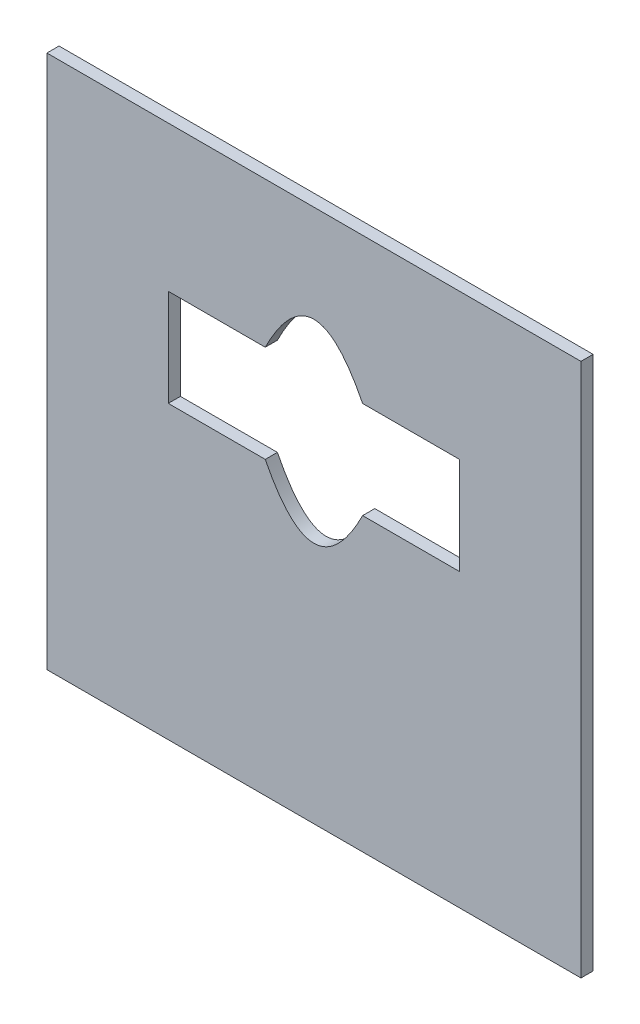
ISO-10303-21;
HEADER;
FILE_DESCRIPTION(('STEP AP214'),'2;1');
FILE_NAME('part.step','',(''),(''),'','','');
FILE_SCHEMA(('AUTOMOTIVE_DESIGN { 1 0 10303 214 1 1 1 1 }'));
ENDSEC;
DATA;
#1=APPLICATION_CONTEXT('core data for automotive mechanical design processes');
#2=APPLICATION_PROTOCOL_DEFINITION('international standard','automotive_design',2000,#1);
#3=PRODUCT_CONTEXT('',#1,'mechanical');
#4=PRODUCT('Part','Part','',(#3));
#5=PRODUCT_RELATED_PRODUCT_CATEGORY('part','',(#4));
#6=PRODUCT_DEFINITION_FORMATION('','',#4);
#7=PRODUCT_DEFINITION_CONTEXT('part definition',#1,'design');
#8=PRODUCT_DEFINITION('design','',#6,#7);
#9=PRODUCT_DEFINITION_SHAPE('','',#8);
#10=(LENGTH_UNIT() NAMED_UNIT(*) SI_UNIT(.MILLI.,.METRE.));
#11=(NAMED_UNIT(*) PLANE_ANGLE_UNIT() SI_UNIT($,.RADIAN.));
#12=(NAMED_UNIT(*) SI_UNIT($,.STERADIAN.) SOLID_ANGLE_UNIT());
#13=UNCERTAINTY_MEASURE_WITH_UNIT(LENGTH_MEASURE(1.E-05),#10,'distance_accuracy_value','');
#14=(GEOMETRIC_REPRESENTATION_CONTEXT(3) GLOBAL_UNCERTAINTY_ASSIGNED_CONTEXT((#13)) GLOBAL_UNIT_ASSIGNED_CONTEXT((#10,
#11,#12)) REPRESENTATION_CONTEXT('',''));
#15=CARTESIAN_POINT('',(0.,0.,0.));
#16=DIRECTION('',(0.,0.,1.));
#17=DIRECTION('',(1.,0.,0.));
#18=AXIS2_PLACEMENT_3D('',#15,#16,#17);
#19=CARTESIAN_POINT('',(0.,0.,3.175));
#20=DIRECTION('',(0.,0.,-1.));
#21=DIRECTION('',(-1.,0.,0.));
#22=AXIS2_PLACEMENT_3D('',#19,#20,#21);
#23=PLANE('',#22);
#24=DIRECTION('',(0.,-1.,0.));
#25=VECTOR('',#24,1.);
#26=CARTESIAN_POINT('',(0.,0.,3.175));
#27=LINE('',#26,#25);
#28=CARTESIAN_POINT('',(0.,139.7,3.175));
#29=VERTEX_POINT('',#28);
#30=CARTESIAN_POINT('',(0.,0.,3.175));
#31=VERTEX_POINT('',#30);
#32=EDGE_CURVE('E206',#29,#31,#27,.T.);
#33=ORIENTED_EDGE('',*,*,#32,.T.);
#34=DIRECTION('',(1.,0.,0.));
#35=VECTOR('',#34,1.);
#36=CARTESIAN_POINT('',(0.,0.,3.175));
#37=LINE('',#36,#35);
#38=CARTESIAN_POINT('',(139.7,0.,3.175));
#39=VERTEX_POINT('',#38);
#40=EDGE_CURVE('E219',#31,#39,#37,.T.);
#41=ORIENTED_EDGE('',*,*,#40,.T.);
#42=DIRECTION('',(0.,1.,0.));
#43=VECTOR('',#42,1.);
#44=CARTESIAN_POINT('',(139.7,0.,3.175));
#45=LINE('',#44,#43);
#46=CARTESIAN_POINT('',(139.7,139.7,3.175));
#47=VERTEX_POINT('',#46);
#48=EDGE_CURVE('E200',#39,#47,#45,.T.);
#49=ORIENTED_EDGE('',*,*,#48,.T.);
#50=DIRECTION('',(-1.,0.,0.));
#51=VECTOR('',#50,1.);
#52=CARTESIAN_POINT('',(0.,139.7,3.175));
#53=LINE('',#52,#51);
#54=EDGE_CURVE('E213',#47,#29,#53,.T.);
#55=ORIENTED_EDGE('',*,*,#54,.T.);
#56=EDGE_LOOP('',(#33,#41,#49,#55));
#57=FACE_BOUND('',#56,.T.);
#58=DIRECTION('',(0.,-1.,0.));
#59=VECTOR('',#58,1.);
#60=CARTESIAN_POINT('',(31.75,101.6,3.175));
#61=LINE('',#60,#59);
#62=CARTESIAN_POINT('',(31.75,101.6,3.175));
#63=VERTEX_POINT('',#62);
#64=CARTESIAN_POINT('',(31.75,76.2,3.175));
#65=VERTEX_POINT('',#64);
#66=EDGE_CURVE('E122',#63,#65,#61,.T.);
#67=ORIENTED_EDGE('',*,*,#66,.F.);
#68=DIRECTION('',(-1.,0.,0.));
#69=VECTOR('',#68,1.);
#70=CARTESIAN_POINT('',(31.75,101.6,3.175));
#71=LINE('',#70,#69);
#72=CARTESIAN_POINT('',(57.1143014780836,101.6,3.175));
#73=VERTEX_POINT('',#72);
#74=EDGE_CURVE('E235',#73,#63,#71,.T.);
#75=ORIENTED_EDGE('',*,*,#74,.F.);
#76=CARTESIAN_POINT('',(82.5856985219164,101.6,3.175));
#77=CARTESIAN_POINT('',(69.85,127.,3.175));
#78=CARTESIAN_POINT('',(57.1143014780836,101.6,3.175));
#79=B_SPLINE_CURVE_WITH_KNOTS('',2,(#76,#77,#78),.UNSPECIFIED.,.F.,.F.,(3,3),(0.,1.),.UNSPECIFIED.);
#80=CARTESIAN_POINT('',(82.5856985219164,101.6,3.175));
#81=VERTEX_POINT('',#80);
#82=EDGE_CURVE('E266',#81,#73,#79,.T.);
#83=ORIENTED_EDGE('',*,*,#82,.F.);
#84=DIRECTION('',(-1.,0.,0.));
#85=VECTOR('',#84,1.);
#86=CARTESIAN_POINT('',(82.5856985219164,101.6,3.175));
#87=LINE('',#86,#85);
#88=CARTESIAN_POINT('',(107.95,101.6,3.175));
#89=VERTEX_POINT('',#88);
#90=EDGE_CURVE('E271',#89,#81,#87,.T.);
#91=ORIENTED_EDGE('',*,*,#90,.F.);
#92=DIRECTION('',(0.,1.,0.));
#93=VECTOR('',#92,1.);
#94=CARTESIAN_POINT('',(107.95,101.6,3.175));
#95=LINE('',#94,#93);
#96=CARTESIAN_POINT('',(107.95,76.2,3.175));
#97=VERTEX_POINT('',#96);
#98=EDGE_CURVE('E300',#97,#89,#95,.T.);
#99=ORIENTED_EDGE('',*,*,#98,.F.);
#100=DIRECTION('',(1.,0.,0.));
#101=VECTOR('',#100,1.);
#102=CARTESIAN_POINT('',(82.5856985219164,76.2,3.175));
#103=LINE('',#102,#101);
#104=CARTESIAN_POINT('',(82.5856985219164,76.2,3.175));
#105=VERTEX_POINT('',#104);
#106=EDGE_CURVE('E145',#105,#97,#103,.T.);
#107=ORIENTED_EDGE('',*,*,#106,.F.);
#108=CARTESIAN_POINT('',(57.1143014780836,76.2,3.175));
#109=CARTESIAN_POINT('',(69.85,50.9177436289501,3.175));
#110=CARTESIAN_POINT('',(82.5856985219164,76.2,3.175));
#111=B_SPLINE_CURVE_WITH_KNOTS('',2,(#108,#109,#110),.UNSPECIFIED.,.F.,.F.,(3,3),(0.,1.),.UNSPECIFIED.);
#112=CARTESIAN_POINT('',(57.1143014780836,76.2,3.175));
#113=VERTEX_POINT('',#112);
#114=EDGE_CURVE('E143',#113,#105,#111,.T.);
#115=ORIENTED_EDGE('',*,*,#114,.F.);
#116=DIRECTION('',(1.,0.,0.));
#117=VECTOR('',#116,1.);
#118=CARTESIAN_POINT('',(31.75,76.2,3.175));
#119=LINE('',#118,#117);
#120=EDGE_CURVE('E130',#65,#113,#119,.T.);
#121=ORIENTED_EDGE('',*,*,#120,.F.);
#122=EDGE_LOOP('',(#67,#75,#83,#91,#99,#107,#115,#121));
#123=FACE_BOUND('',#122,.T.);
#124=ADVANCED_FACE('F33',(#57,#123),#23,.F.);
#125=CARTESIAN_POINT('',(0.,0.,0.));
#126=DIRECTION('',(0.,0.,-1.));
#127=DIRECTION('',(-1.,0.,0.));
#128=AXIS2_PLACEMENT_3D('',#125,#126,#127);
#129=PLANE('',#128);
#130=DIRECTION('',(0.,-1.,0.));
#131=VECTOR('',#130,1.);
#132=CARTESIAN_POINT('',(0.,0.,0.));
#133=LINE('',#132,#131);
#134=CARTESIAN_POINT('',(0.,139.7,0.));
#135=VERTEX_POINT('',#134);
#136=CARTESIAN_POINT('',(0.,0.,0.));
#137=VERTEX_POINT('',#136);
#138=EDGE_CURVE('E138',#135,#137,#133,.T.);
#139=ORIENTED_EDGE('',*,*,#138,.F.);
#140=DIRECTION('',(-1.,0.,0.));
#141=VECTOR('',#140,1.);
#142=CARTESIAN_POINT('',(0.,139.7,0.));
#143=LINE('',#142,#141);
#144=CARTESIAN_POINT('',(139.7,139.7,0.));
#145=VERTEX_POINT('',#144);
#146=EDGE_CURVE('E204',#145,#135,#143,.T.);
#147=ORIENTED_EDGE('',*,*,#146,.F.);
#148=DIRECTION('',(0.,1.,0.));
#149=VECTOR('',#148,1.);
#150=CARTESIAN_POINT('',(139.7,0.,0.));
#151=LINE('',#150,#149);
#152=CARTESIAN_POINT('',(139.7,0.,0.));
#153=VERTEX_POINT('',#152);
#154=EDGE_CURVE('E196',#153,#145,#151,.T.);
#155=ORIENTED_EDGE('',*,*,#154,.F.);
#156=DIRECTION('',(1.,0.,0.));
#157=VECTOR('',#156,1.);
#158=CARTESIAN_POINT('',(0.,0.,0.));
#159=LINE('',#158,#157);
#160=EDGE_CURVE('E189',#137,#153,#159,.T.);
#161=ORIENTED_EDGE('',*,*,#160,.F.);
#162=EDGE_LOOP('',(#139,#147,#155,#161));
#163=FACE_BOUND('',#162,.T.);
#164=DIRECTION('',(-1.,0.,0.));
#165=VECTOR('',#164,1.);
#166=CARTESIAN_POINT('',(31.75,101.6,0.));
#167=LINE('',#166,#165);
#168=CARTESIAN_POINT('',(57.1143014780836,101.6,0.));
#169=VERTEX_POINT('',#168);
#170=CARTESIAN_POINT('',(31.75,101.6,0.));
#171=VERTEX_POINT('',#170);
#172=EDGE_CURVE('E131',#169,#171,#167,.T.);
#173=ORIENTED_EDGE('',*,*,#172,.T.);
#174=DIRECTION('',(0.,-1.,0.));
#175=VECTOR('',#174,1.);
#176=CARTESIAN_POINT('',(31.75,101.6,0.));
#177=LINE('',#176,#175);
#178=CARTESIAN_POINT('',(31.75,76.2,0.));
#179=VERTEX_POINT('',#178);
#180=EDGE_CURVE('E56',#171,#179,#177,.T.);
#181=ORIENTED_EDGE('',*,*,#180,.T.);
#182=DIRECTION('',(1.,0.,0.));
#183=VECTOR('',#182,1.);
#184=CARTESIAN_POINT('',(31.75,76.2,0.));
#185=LINE('',#184,#183);
#186=CARTESIAN_POINT('',(57.1143014780836,76.2,0.));
#187=VERTEX_POINT('',#186);
#188=EDGE_CURVE('E137',#179,#187,#185,.T.);
#189=ORIENTED_EDGE('',*,*,#188,.T.);
#190=CARTESIAN_POINT('',(57.1143014780836,76.2,0.));
#191=CARTESIAN_POINT('',(69.85,50.9177436289501,0.));
#192=CARTESIAN_POINT('',(82.5856985219164,76.2,0.));
#193=B_SPLINE_CURVE_WITH_KNOTS('',2,(#190,#191,#192),.UNSPECIFIED.,.F.,.F.,(3,3),(0.,1.),.UNSPECIFIED.);
#194=CARTESIAN_POINT('',(82.5856985219164,76.2,0.));
#195=VERTEX_POINT('',#194);
#196=EDGE_CURVE('E255',#187,#195,#193,.T.);
#197=ORIENTED_EDGE('',*,*,#196,.T.);
#198=DIRECTION('',(1.,0.,0.));
#199=VECTOR('',#198,1.);
#200=CARTESIAN_POINT('',(82.5856985219164,76.2,0.));
#201=LINE('',#200,#199);
#202=CARTESIAN_POINT('',(107.95,76.2,0.));
#203=VERTEX_POINT('',#202);
#204=EDGE_CURVE('E252',#195,#203,#201,.T.);
#205=ORIENTED_EDGE('',*,*,#204,.T.);
#206=DIRECTION('',(0.,1.,0.));
#207=VECTOR('',#206,1.);
#208=CARTESIAN_POINT('',(107.95,101.6,0.));
#209=LINE('',#208,#207);
#210=CARTESIAN_POINT('',(107.95,101.6,0.));
#211=VERTEX_POINT('',#210);
#212=EDGE_CURVE('E249',#203,#211,#209,.T.);
#213=ORIENTED_EDGE('',*,*,#212,.T.);
#214=DIRECTION('',(-1.,0.,0.));
#215=VECTOR('',#214,1.);
#216=CARTESIAN_POINT('',(82.5856985219164,101.6,0.));
#217=LINE('',#216,#215);
#218=CARTESIAN_POINT('',(82.5856985219164,101.6,0.));
#219=VERTEX_POINT('',#218);
#220=EDGE_CURVE('E243',#211,#219,#217,.T.);
#221=ORIENTED_EDGE('',*,*,#220,.T.);
#222=CARTESIAN_POINT('',(82.5856985219164,101.6,0.));
#223=CARTESIAN_POINT('',(69.85,127.,0.));
#224=CARTESIAN_POINT('',(57.1143014780836,101.6,0.));
#225=B_SPLINE_CURVE_WITH_KNOTS('',2,(#222,#223,#224),.UNSPECIFIED.,.F.,.F.,(3,3),(0.,1.),.UNSPECIFIED.);
#226=EDGE_CURVE('E238',#219,#169,#225,.T.);
#227=ORIENTED_EDGE('',*,*,#226,.T.);
#228=EDGE_LOOP('',(#173,#181,#189,#197,#205,#213,#221,#227));
#229=FACE_BOUND('',#228,.T.);
#230=ADVANCED_FACE('F170',(#163,#229),#129,.T.);
#231=CARTESIAN_POINT('',(0.,0.,3.175));
#232=DIRECTION('',(1.,0.,0.));
#233=DIRECTION('',(0.,0.,-1.));
#234=AXIS2_PLACEMENT_3D('',#231,#232,#233);
#235=PLANE('',#234);
#236=ORIENTED_EDGE('',*,*,#138,.T.);
#237=DIRECTION('',(0.,0.,-1.));
#238=VECTOR('',#237,1.);
#239=CARTESIAN_POINT('',(0.,0.,3.175));
#240=LINE('',#239,#238);
#241=EDGE_CURVE('E11',#31,#137,#240,.T.);
#242=ORIENTED_EDGE('',*,*,#241,.F.);
#243=ORIENTED_EDGE('',*,*,#32,.F.);
#244=DIRECTION('',(0.,0.,-1.));
#245=VECTOR('',#244,1.);
#246=CARTESIAN_POINT('',(0.,139.7,3.175));
#247=LINE('',#246,#245);
#248=EDGE_CURVE('E210',#29,#135,#247,.T.);
#249=ORIENTED_EDGE('',*,*,#248,.T.);
#250=EDGE_LOOP('',(#236,#242,#243,#249));
#251=FACE_BOUND('',#250,.T.);
#252=ADVANCED_FACE('F35',(#251),#235,.F.);
#253=CARTESIAN_POINT('',(0.,0.,3.175));
#254=DIRECTION('',(0.,1.,0.));
#255=DIRECTION('',(0.,0.,1.));
#256=AXIS2_PLACEMENT_3D('',#253,#254,#255);
#257=PLANE('',#256);
#258=ORIENTED_EDGE('',*,*,#160,.T.);
#259=DIRECTION('',(0.,0.,-1.));
#260=VECTOR('',#259,1.);
#261=CARTESIAN_POINT('',(139.7,0.,3.175));
#262=LINE('',#261,#260);
#263=EDGE_CURVE('E41',#39,#153,#262,.T.);
#264=ORIENTED_EDGE('',*,*,#263,.F.);
#265=ORIENTED_EDGE('',*,*,#40,.F.);
#266=ORIENTED_EDGE('',*,*,#241,.T.);
#267=EDGE_LOOP('',(#258,#264,#265,#266));
#268=FACE_BOUND('',#267,.T.);
#269=ADVANCED_FACE('F180',(#268),#257,.F.);
#270=CARTESIAN_POINT('',(139.7,0.,3.175));
#271=DIRECTION('',(-1.,0.,0.));
#272=DIRECTION('',(0.,0.,1.));
#273=AXIS2_PLACEMENT_3D('',#270,#271,#272);
#274=PLANE('',#273);
#275=ORIENTED_EDGE('',*,*,#154,.T.);
#276=DIRECTION('',(0.,0.,-1.));
#277=VECTOR('',#276,1.);
#278=CARTESIAN_POINT('',(139.7,139.7,3.175));
#279=LINE('',#278,#277);
#280=EDGE_CURVE('E201',#47,#145,#279,.T.);
#281=ORIENTED_EDGE('',*,*,#280,.F.);
#282=ORIENTED_EDGE('',*,*,#48,.F.);
#283=ORIENTED_EDGE('',*,*,#263,.T.);
#284=EDGE_LOOP('',(#275,#281,#282,#283));
#285=FACE_BOUND('',#284,.T.);
#286=ADVANCED_FACE('F177',(#285),#274,.F.);
#287=CARTESIAN_POINT('',(0.,139.7,3.175));
#288=DIRECTION('',(0.,-1.,0.));
#289=DIRECTION('',(0.,0.,-1.));
#290=AXIS2_PLACEMENT_3D('',#287,#288,#289);
#291=PLANE('',#290);
#292=ORIENTED_EDGE('',*,*,#146,.T.);
#293=ORIENTED_EDGE('',*,*,#248,.F.);
#294=ORIENTED_EDGE('',*,*,#54,.F.);
#295=ORIENTED_EDGE('',*,*,#280,.T.);
#296=EDGE_LOOP('',(#292,#293,#294,#295));
#297=FACE_BOUND('',#296,.T.);
#298=ADVANCED_FACE('F167',(#297),#291,.F.);
#299=CARTESIAN_POINT('',(31.75,101.6,3.175));
#300=DIRECTION('',(1.,0.,0.));
#301=DIRECTION('',(0.,0.,-1.));
#302=AXIS2_PLACEMENT_3D('',#299,#300,#301);
#303=PLANE('',#302);
#304=ORIENTED_EDGE('',*,*,#180,.F.);
#305=DIRECTION('',(0.,0.,-1.));
#306=VECTOR('',#305,1.);
#307=CARTESIAN_POINT('',(31.75,101.6,3.175));
#308=LINE('',#307,#306);
#309=EDGE_CURVE('E126',#63,#171,#308,.T.);
#310=ORIENTED_EDGE('',*,*,#309,.F.);
#311=ORIENTED_EDGE('',*,*,#66,.T.);
#312=DIRECTION('',(0.,0.,-1.));
#313=VECTOR('',#312,1.);
#314=CARTESIAN_POINT('',(31.75,76.2,3.175));
#315=LINE('',#314,#313);
#316=EDGE_CURVE('E125',#65,#179,#315,.T.);
#317=ORIENTED_EDGE('',*,*,#316,.T.);
#318=EDGE_LOOP('',(#304,#310,#311,#317));
#319=FACE_BOUND('',#318,.T.);
#320=ADVANCED_FACE('F124',(#319),#303,.T.);
#321=CARTESIAN_POINT('',(31.75,76.2,3.175));
#322=DIRECTION('',(0.,1.,0.));
#323=DIRECTION('',(0.,0.,1.));
#324=AXIS2_PLACEMENT_3D('',#321,#322,#323);
#325=PLANE('',#324);
#326=ORIENTED_EDGE('',*,*,#188,.F.);
#327=ORIENTED_EDGE('',*,*,#316,.F.);
#328=ORIENTED_EDGE('',*,*,#120,.T.);
#329=DIRECTION('',(0.,0.,-1.));
#330=VECTOR('',#329,1.);
#331=CARTESIAN_POINT('',(57.1143014780836,76.2,3.175));
#332=LINE('',#331,#330);
#333=EDGE_CURVE('E139',#113,#187,#332,.T.);
#334=ORIENTED_EDGE('',*,*,#333,.T.);
#335=EDGE_LOOP('',(#326,#327,#328,#334));
#336=FACE_BOUND('',#335,.T.);
#337=ADVANCED_FACE('F134',(#336),#325,.T.);
#338=DIRECTION('',(0.,0.,-1.));
#339=VECTOR('',#338,1.);
#340=SURFACE_OF_LINEAR_EXTRUSION('',#111,#339);
#341=ORIENTED_EDGE('',*,*,#196,.F.);
#342=ORIENTED_EDGE('',*,*,#333,.F.);
#343=ORIENTED_EDGE('',*,*,#114,.T.);
#344=DIRECTION('',(0.,0.,-1.));
#345=VECTOR('',#344,1.);
#346=CARTESIAN_POINT('',(82.5856985219164,76.2,3.175));
#347=LINE('',#346,#345);
#348=EDGE_CURVE('E225',#105,#195,#347,.T.);
#349=ORIENTED_EDGE('',*,*,#348,.T.);
#350=EDGE_LOOP('',(#341,#342,#343,#349));
#351=FACE_BOUND('',#350,.T.);
#352=ADVANCED_FACE('F156',(#351),#340,.T.);
#353=CARTESIAN_POINT('',(82.5856985219164,76.2,3.175));
#354=DIRECTION('',(0.,1.,0.));
#355=DIRECTION('',(0.,0.,1.));
#356=AXIS2_PLACEMENT_3D('',#353,#354,#355);
#357=PLANE('',#356);
#358=ORIENTED_EDGE('',*,*,#204,.F.);
#359=ORIENTED_EDGE('',*,*,#348,.F.);
#360=ORIENTED_EDGE('',*,*,#106,.T.);
#361=DIRECTION('',(0.,0.,-1.));
#362=VECTOR('',#361,1.);
#363=CARTESIAN_POINT('',(107.95,76.2,3.175));
#364=LINE('',#363,#362);
#365=EDGE_CURVE('E227',#97,#203,#364,.T.);
#366=ORIENTED_EDGE('',*,*,#365,.T.);
#367=EDGE_LOOP('',(#358,#359,#360,#366));
#368=FACE_BOUND('',#367,.T.);
#369=ADVANCED_FACE('F160',(#368),#357,.T.);
#370=CARTESIAN_POINT('',(107.95,101.6,3.175));
#371=DIRECTION('',(-1.,0.,0.));
#372=DIRECTION('',(0.,0.,1.));
#373=AXIS2_PLACEMENT_3D('',#370,#371,#372);
#374=PLANE('',#373);
#375=ORIENTED_EDGE('',*,*,#212,.F.);
#376=ORIENTED_EDGE('',*,*,#365,.F.);
#377=ORIENTED_EDGE('',*,*,#98,.T.);
#378=DIRECTION('',(0.,0.,-1.));
#379=VECTOR('',#378,1.);
#380=CARTESIAN_POINT('',(107.95,101.6,3.175));
#381=LINE('',#380,#379);
#382=EDGE_CURVE('E229',#89,#211,#381,.T.);
#383=ORIENTED_EDGE('',*,*,#382,.T.);
#384=EDGE_LOOP('',(#375,#376,#377,#383));
#385=FACE_BOUND('',#384,.T.);
#386=ADVANCED_FACE('F284',(#385),#374,.T.);
#387=CARTESIAN_POINT('',(82.5856985219164,101.6,3.175));
#388=DIRECTION('',(0.,-1.,0.));
#389=DIRECTION('',(0.,0.,-1.));
#390=AXIS2_PLACEMENT_3D('',#387,#388,#389);
#391=PLANE('',#390);
#392=ORIENTED_EDGE('',*,*,#220,.F.);
#393=ORIENTED_EDGE('',*,*,#382,.F.);
#394=ORIENTED_EDGE('',*,*,#90,.T.);
#395=DIRECTION('',(0.,0.,-1.));
#396=VECTOR('',#395,1.);
#397=CARTESIAN_POINT('',(82.5856985219164,101.6,3.175));
#398=LINE('',#397,#396);
#399=EDGE_CURVE('E231',#81,#219,#398,.T.);
#400=ORIENTED_EDGE('',*,*,#399,.T.);
#401=EDGE_LOOP('',(#392,#393,#394,#400));
#402=FACE_BOUND('',#401,.T.);
#403=ADVANCED_FACE('F281',(#402),#391,.T.);
#404=DIRECTION('',(0.,0.,-1.));
#405=VECTOR('',#404,1.);
#406=SURFACE_OF_LINEAR_EXTRUSION('',#79,#405);
#407=ORIENTED_EDGE('',*,*,#226,.F.);
#408=ORIENTED_EDGE('',*,*,#399,.F.);
#409=ORIENTED_EDGE('',*,*,#82,.T.);
#410=DIRECTION('',(0.,0.,-1.));
#411=VECTOR('',#410,1.);
#412=CARTESIAN_POINT('',(57.1143014780836,101.6,3.175));
#413=LINE('',#412,#411);
#414=EDGE_CURVE('E48',#73,#169,#413,.T.);
#415=ORIENTED_EDGE('',*,*,#414,.T.);
#416=EDGE_LOOP('',(#407,#408,#409,#415));
#417=FACE_BOUND('',#416,.T.);
#418=ADVANCED_FACE('F276',(#417),#406,.T.);
#419=CARTESIAN_POINT('',(31.75,101.6,3.175));
#420=DIRECTION('',(0.,-1.,0.));
#421=DIRECTION('',(0.,0.,-1.));
#422=AXIS2_PLACEMENT_3D('',#419,#420,#421);
#423=PLANE('',#422);
#424=ORIENTED_EDGE('',*,*,#172,.F.);
#425=ORIENTED_EDGE('',*,*,#414,.F.);
#426=ORIENTED_EDGE('',*,*,#74,.T.);
#427=ORIENTED_EDGE('',*,*,#309,.T.);
#428=EDGE_LOOP('',(#424,#425,#426,#427));
#429=FACE_BOUND('',#428,.T.);
#430=ADVANCED_FACE('F280',(#429),#423,.T.);
#431=CLOSED_SHELL('',(#124,#230,#252,#269,#286,#298,#320,#337,#352,#369,#386,#403,#418,#430));
#432=MANIFOLD_SOLID_BREP('B2',#431);
#433=ADVANCED_BREP_SHAPE_REPRESENTATION('',(#18,#432),#14);
#434=SHAPE_DEFINITION_REPRESENTATION(#9,#433);
ENDSEC;
END-ISO-10303-21;
